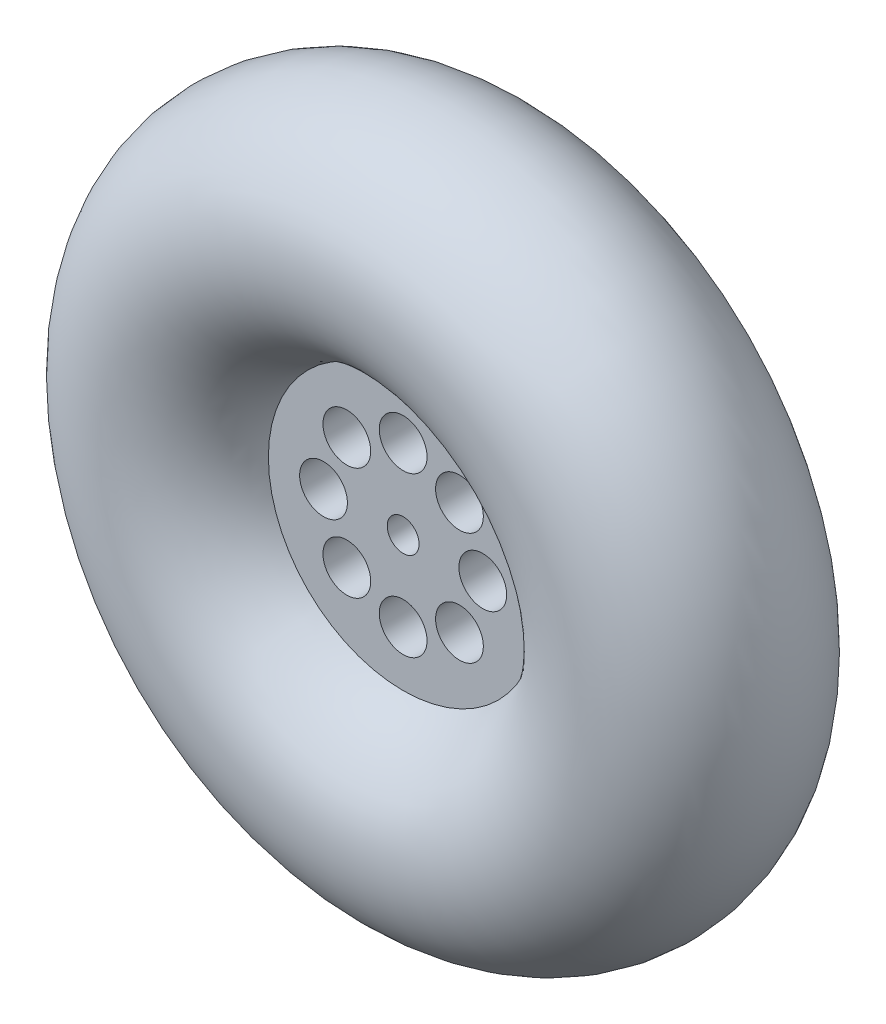
ISO-10303-21;
HEADER;
FILE_DESCRIPTION(('STEP AP214'),'2;1');
FILE_NAME('part.step','',(''),(''),'','','');
FILE_SCHEMA(('AUTOMOTIVE_DESIGN { 1 0 10303 214 1 1 1 1 }'));
ENDSEC;
DATA;
#1=APPLICATION_CONTEXT('core data for automotive mechanical design processes');
#2=APPLICATION_PROTOCOL_DEFINITION('international standard','automotive_design',2000,#1);
#3=PRODUCT_CONTEXT('',#1,'mechanical');
#4=PRODUCT('Part','Part','',(#3));
#5=PRODUCT_RELATED_PRODUCT_CATEGORY('part','',(#4));
#6=PRODUCT_DEFINITION_FORMATION('','',#4);
#7=PRODUCT_DEFINITION_CONTEXT('part definition',#1,'design');
#8=PRODUCT_DEFINITION('design','',#6,#7);
#9=PRODUCT_DEFINITION_SHAPE('','',#8);
#10=(LENGTH_UNIT() NAMED_UNIT(*) SI_UNIT(.MILLI.,.METRE.));
#11=(NAMED_UNIT(*) PLANE_ANGLE_UNIT() SI_UNIT($,.RADIAN.));
#12=(NAMED_UNIT(*) SI_UNIT($,.STERADIAN.) SOLID_ANGLE_UNIT());
#13=UNCERTAINTY_MEASURE_WITH_UNIT(LENGTH_MEASURE(1.E-05),#10,'distance_accuracy_value','');
#14=(GEOMETRIC_REPRESENTATION_CONTEXT(3) GLOBAL_UNCERTAINTY_ASSIGNED_CONTEXT((#13)) GLOBAL_UNIT_ASSIGNED_CONTEXT((#10,
#11,#12)) REPRESENTATION_CONTEXT('',''));
#15=CARTESIAN_POINT('',(0.,0.,0.));
#16=DIRECTION('',(0.,0.,1.));
#17=DIRECTION('',(1.,0.,0.));
#18=AXIS2_PLACEMENT_3D('',#15,#16,#17);
#19=CARTESIAN_POINT('',(0.,0.,0.));
#20=DIRECTION('',(0.,0.,1.));
#21=DIRECTION('',(1.,0.,0.));
#22=AXIS2_PLACEMENT_3D('',#19,#20,#21);
#23=TOROIDAL_SURFACE('',#22,30.,14.);
#24=CARTESIAN_POINT('',(0.,0.,5.));
#25=DIRECTION('',(0.,0.,-1.));
#26=DIRECTION('',(-1.,0.,0.));
#27=AXIS2_PLACEMENT_3D('',#24,#25,#26);
#28=CIRCLE('',#27,16.923303169378);
#29=CARTESIAN_POINT('',(-16.923303169378,0.,5.));
#30=VERTEX_POINT('',#29);
#31=EDGE_CURVE('E42',#30,#30,#28,.T.);
#32=ORIENTED_EDGE('',*,*,#31,.T.);
#33=EDGE_LOOP('',(#32));
#34=FACE_BOUND('',#33,.T.);
#35=CARTESIAN_POINT('',(0.,0.,-5.));
#36=DIRECTION('',(0.,0.,-1.));
#37=DIRECTION('',(-1.,0.,0.));
#38=AXIS2_PLACEMENT_3D('',#35,#36,#37);
#39=CIRCLE('',#38,16.923303169378);
#40=CARTESIAN_POINT('',(-16.923303169378,0.,-5.));
#41=VERTEX_POINT('',#40);
#42=EDGE_CURVE('E10',#41,#41,#39,.T.);
#43=ORIENTED_EDGE('',*,*,#42,.F.);
#44=EDGE_LOOP('',(#43));
#45=FACE_BOUND('',#44,.T.);
#46=ADVANCED_FACE('F35',(#34,#45),#23,.T.);
#47=CARTESIAN_POINT('',(0.,0.,5.));
#48=DIRECTION('',(0.,0.,1.));
#49=DIRECTION('',(1.,0.,0.));
#50=AXIS2_PLACEMENT_3D('',#47,#48,#49);
#51=PLANE('',#50);
#52=CARTESIAN_POINT('',(-7.07106781186535,7.07106781186517,5.));
#53=DIRECTION('',(0.,0.,1.));
#54=DIRECTION('',(1.,0.,0.));
#55=AXIS2_PLACEMENT_3D('',#52,#53,#54);
#56=CIRCLE('',#55,3.00000000000033);
#57=CARTESIAN_POINT('',(-4.07106781186503,7.07106781186517,5.));
#58=VERTEX_POINT('',#57);
#59=EDGE_CURVE('E88',#58,#58,#56,.T.);
#60=ORIENTED_EDGE('',*,*,#59,.F.);
#61=EDGE_LOOP('',(#60));
#62=FACE_BOUND('',#61,.T.);
#63=CARTESIAN_POINT('',(-9.99999999999958,-4.2632564145606E-13,5.));
#64=DIRECTION('',(0.,0.,1.));
#65=DIRECTION('',(1.,0.,0.));
#66=AXIS2_PLACEMENT_3D('',#63,#64,#65);
#67=CIRCLE('',#66,3.00000000000063);
#68=CARTESIAN_POINT('',(-6.99999999999894,-4.2632564145606E-13,5.));
#69=VERTEX_POINT('',#68);
#70=EDGE_CURVE('E91',#69,#69,#67,.T.);
#71=ORIENTED_EDGE('',*,*,#70,.F.);
#72=EDGE_LOOP('',(#71));
#73=FACE_BOUND('',#72,.T.);
#74=CARTESIAN_POINT('',(-7.07106781186475,-7.07106781186578,5.));
#75=DIRECTION('',(0.,0.,1.));
#76=DIRECTION('',(1.,0.,0.));
#77=AXIS2_PLACEMENT_3D('',#74,#75,#76);
#78=CIRCLE('',#77,3.00000000000086);
#79=CARTESIAN_POINT('',(-4.07106781186389,-7.07106781186578,5.));
#80=VERTEX_POINT('',#79);
#81=EDGE_CURVE('E94',#80,#80,#78,.T.);
#82=ORIENTED_EDGE('',*,*,#81,.F.);
#83=EDGE_LOOP('',(#82));
#84=FACE_BOUND('',#83,.T.);
#85=CARTESIAN_POINT('',(8.50201989313825E-13,-10.,5.));
#86=DIRECTION('',(0.,0.,1.));
#87=DIRECTION('',(1.,0.,0.));
#88=AXIS2_PLACEMENT_3D('',#85,#86,#87);
#89=CIRCLE('',#88,3.00000000000088);
#90=CARTESIAN_POINT('',(3.00000000000173,-10.,5.));
#91=VERTEX_POINT('',#90);
#92=EDGE_CURVE('E97',#91,#91,#89,.T.);
#93=ORIENTED_EDGE('',*,*,#92,.F.);
#94=EDGE_LOOP('',(#93));
#95=FACE_BOUND('',#94,.T.);
#96=CARTESIAN_POINT('',(7.0710678118662,-7.07106781186517,5.));
#97=DIRECTION('',(0.,0.,1.));
#98=DIRECTION('',(1.,0.,0.));
#99=AXIS2_PLACEMENT_3D('',#96,#97,#98);
#100=CIRCLE('',#99,3.00000000000066);
#101=CARTESIAN_POINT('',(10.0710678118669,-7.07106781186517,5.));
#102=VERTEX_POINT('',#101);
#103=EDGE_CURVE('E100',#102,#102,#100,.T.);
#104=ORIENTED_EDGE('',*,*,#103,.F.);
#105=EDGE_LOOP('',(#104));
#106=FACE_BOUND('',#105,.T.);
#107=CARTESIAN_POINT('',(10.0000000000004,4.25100994656913E-13,5.));
#108=DIRECTION('',(0.,0.,1.));
#109=DIRECTION('',(1.,0.,0.));
#110=AXIS2_PLACEMENT_3D('',#107,#108,#109);
#111=CIRCLE('',#110,3.00000000000032);
#112=CARTESIAN_POINT('',(13.0000000000007,4.25100994656913E-13,5.));
#113=VERTEX_POINT('',#112);
#114=EDGE_CURVE('E103',#113,#113,#111,.T.);
#115=ORIENTED_EDGE('',*,*,#114,.F.);
#116=EDGE_LOOP('',(#115));
#117=FACE_BOUND('',#116,.T.);
#118=CARTESIAN_POINT('',(7.0710678118656,7.07106781186578,5.));
#119=DIRECTION('',(0.,0.,1.));
#120=DIRECTION('',(1.,0.,0.));
#121=AXIS2_PLACEMENT_3D('',#118,#119,#120);
#122=CIRCLE('',#121,3.00000000000005);
#123=CARTESIAN_POINT('',(10.0710678118656,7.07106781186578,5.));
#124=VERTEX_POINT('',#123);
#125=EDGE_CURVE('E87',#124,#124,#122,.T.);
#126=ORIENTED_EDGE('',*,*,#125,.F.);
#127=EDGE_LOOP('',(#126));
#128=FACE_BOUND('',#127,.T.);
#129=CARTESIAN_POINT('',(0.,10.,5.));
#130=DIRECTION('',(0.,0.,1.));
#131=DIRECTION('',(1.,0.,0.));
#132=AXIS2_PLACEMENT_3D('',#129,#130,#131);
#133=CIRCLE('',#132,3.);
#134=CARTESIAN_POINT('',(3.,10.,5.));
#135=VERTEX_POINT('',#134);
#136=EDGE_CURVE('E57',#135,#135,#133,.T.);
#137=ORIENTED_EDGE('',*,*,#136,.F.);
#138=EDGE_LOOP('',(#137));
#139=FACE_BOUND('',#138,.T.);
#140=CARTESIAN_POINT('',(0.,0.,5.));
#141=DIRECTION('',(0.,0.,1.));
#142=DIRECTION('',(1.,0.,0.));
#143=AXIS2_PLACEMENT_3D('',#140,#141,#142);
#144=CIRCLE('',#143,2.);
#145=CARTESIAN_POINT('',(2.,0.,5.));
#146=VERTEX_POINT('',#145);
#147=EDGE_CURVE('E47',#146,#146,#144,.T.);
#148=ORIENTED_EDGE('',*,*,#147,.F.);
#149=EDGE_LOOP('',(#148));
#150=FACE_BOUND('',#149,.T.);
#151=ORIENTED_EDGE('',*,*,#31,.F.);
#152=EDGE_LOOP('',(#151));
#153=FACE_BOUND('',#152,.T.);
#154=ADVANCED_FACE('F112',(#62,#73,#84,#95,#106,#117,#128,#139,#150,#153),#51,.T.);
#155=CARTESIAN_POINT('',(0.,0.,-5.));
#156=DIRECTION('',(0.,0.,1.));
#157=DIRECTION('',(1.,0.,0.));
#158=AXIS2_PLACEMENT_3D('',#155,#156,#157);
#159=PLANE('',#158);
#160=CARTESIAN_POINT('',(-7.07106781186535,7.07106781186517,-5.));
#161=DIRECTION('',(0.,0.,1.));
#162=DIRECTION('',(1.,0.,0.));
#163=AXIS2_PLACEMENT_3D('',#160,#161,#162);
#164=CIRCLE('',#163,3.00000000000033);
#165=CARTESIAN_POINT('',(-4.07106781186503,7.07106781186517,-5.));
#166=VERTEX_POINT('',#165);
#167=EDGE_CURVE('E38',#166,#166,#164,.T.);
#168=ORIENTED_EDGE('',*,*,#167,.T.);
#169=EDGE_LOOP('',(#168));
#170=FACE_BOUND('',#169,.T.);
#171=CARTESIAN_POINT('',(-9.99999999999958,-4.2632564145606E-13,-5.));
#172=DIRECTION('',(0.,0.,1.));
#173=DIRECTION('',(1.,0.,0.));
#174=AXIS2_PLACEMENT_3D('',#171,#172,#173);
#175=CIRCLE('',#174,3.00000000000063);
#176=CARTESIAN_POINT('',(-6.99999999999894,-4.2632564145606E-13,-5.));
#177=VERTEX_POINT('',#176);
#178=EDGE_CURVE('E71',#177,#177,#175,.T.);
#179=ORIENTED_EDGE('',*,*,#178,.T.);
#180=EDGE_LOOP('',(#179));
#181=FACE_BOUND('',#180,.T.);
#182=CARTESIAN_POINT('',(-7.07106781186475,-7.07106781186578,-5.));
#183=DIRECTION('',(0.,0.,1.));
#184=DIRECTION('',(1.,0.,0.));
#185=AXIS2_PLACEMENT_3D('',#182,#183,#184);
#186=CIRCLE('',#185,3.00000000000086);
#187=CARTESIAN_POINT('',(-4.07106781186389,-7.07106781186578,-5.));
#188=VERTEX_POINT('',#187);
#189=EDGE_CURVE('E69',#188,#188,#186,.T.);
#190=ORIENTED_EDGE('',*,*,#189,.T.);
#191=EDGE_LOOP('',(#190));
#192=FACE_BOUND('',#191,.T.);
#193=CARTESIAN_POINT('',(8.50201989313825E-13,-10.,-5.));
#194=DIRECTION('',(0.,0.,1.));
#195=DIRECTION('',(1.,0.,0.));
#196=AXIS2_PLACEMENT_3D('',#193,#194,#195);
#197=CIRCLE('',#196,3.00000000000088);
#198=CARTESIAN_POINT('',(3.00000000000173,-10.,-5.));
#199=VERTEX_POINT('',#198);
#200=EDGE_CURVE('E66',#199,#199,#197,.T.);
#201=ORIENTED_EDGE('',*,*,#200,.T.);
#202=EDGE_LOOP('',(#201));
#203=FACE_BOUND('',#202,.T.);
#204=CARTESIAN_POINT('',(7.0710678118662,-7.07106781186517,-5.));
#205=DIRECTION('',(0.,0.,1.));
#206=DIRECTION('',(1.,0.,0.));
#207=AXIS2_PLACEMENT_3D('',#204,#205,#206);
#208=CIRCLE('',#207,3.00000000000066);
#209=CARTESIAN_POINT('',(10.0710678118669,-7.07106781186517,-5.));
#210=VERTEX_POINT('',#209);
#211=EDGE_CURVE('E63',#210,#210,#208,.T.);
#212=ORIENTED_EDGE('',*,*,#211,.T.);
#213=EDGE_LOOP('',(#212));
#214=FACE_BOUND('',#213,.T.);
#215=CARTESIAN_POINT('',(10.0000000000004,4.25100994656913E-13,-5.));
#216=DIRECTION('',(0.,0.,1.));
#217=DIRECTION('',(1.,0.,0.));
#218=AXIS2_PLACEMENT_3D('',#215,#216,#217);
#219=CIRCLE('',#218,3.00000000000032);
#220=CARTESIAN_POINT('',(13.0000000000007,4.25100994656913E-13,-5.));
#221=VERTEX_POINT('',#220);
#222=EDGE_CURVE('E60',#221,#221,#219,.T.);
#223=ORIENTED_EDGE('',*,*,#222,.T.);
#224=EDGE_LOOP('',(#223));
#225=FACE_BOUND('',#224,.T.);
#226=CARTESIAN_POINT('',(7.0710678118656,7.07106781186578,-5.));
#227=DIRECTION('',(0.,0.,1.));
#228=DIRECTION('',(1.,0.,0.));
#229=AXIS2_PLACEMENT_3D('',#226,#227,#228);
#230=CIRCLE('',#229,3.00000000000005);
#231=CARTESIAN_POINT('',(10.0710678118656,7.07106781186578,-5.));
#232=VERTEX_POINT('',#231);
#233=EDGE_CURVE('E56',#232,#232,#230,.T.);
#234=ORIENTED_EDGE('',*,*,#233,.T.);
#235=EDGE_LOOP('',(#234));
#236=FACE_BOUND('',#235,.T.);
#237=CARTESIAN_POINT('',(0.,10.,-5.));
#238=DIRECTION('',(0.,0.,1.));
#239=DIRECTION('',(1.,0.,0.));
#240=AXIS2_PLACEMENT_3D('',#237,#238,#239);
#241=CIRCLE('',#240,3.);
#242=CARTESIAN_POINT('',(3.,10.,-5.));
#243=VERTEX_POINT('',#242);
#244=EDGE_CURVE('E53',#243,#243,#241,.T.);
#245=ORIENTED_EDGE('',*,*,#244,.T.);
#246=EDGE_LOOP('',(#245));
#247=FACE_BOUND('',#246,.T.);
#248=CARTESIAN_POINT('',(0.,0.,-5.));
#249=DIRECTION('',(0.,0.,1.));
#250=DIRECTION('',(1.,0.,0.));
#251=AXIS2_PLACEMENT_3D('',#248,#249,#250);
#252=CIRCLE('',#251,2.);
#253=CARTESIAN_POINT('',(2.,0.,-5.));
#254=VERTEX_POINT('',#253);
#255=EDGE_CURVE('E50',#254,#254,#252,.T.);
#256=ORIENTED_EDGE('',*,*,#255,.T.);
#257=EDGE_LOOP('',(#256));
#258=FACE_BOUND('',#257,.T.);
#259=ORIENTED_EDGE('',*,*,#42,.T.);
#260=EDGE_LOOP('',(#259));
#261=FACE_BOUND('',#260,.T.);
#262=ADVANCED_FACE('F115',(#170,#181,#192,#203,#214,#225,#236,#247,#258,#261),#159,.F.);
#263=CARTESIAN_POINT('',(0.,0.,5.));
#264=DIRECTION('',(0.,0.,-1.));
#265=DIRECTION('',(-1.,0.,0.));
#266=AXIS2_PLACEMENT_3D('',#263,#264,#265);
#267=CYLINDRICAL_SURFACE('',#266,2.);
#268=ORIENTED_EDGE('',*,*,#147,.T.);
#269=EDGE_LOOP('',(#268));
#270=FACE_BOUND('',#269,.T.);
#271=ORIENTED_EDGE('',*,*,#255,.F.);
#272=EDGE_LOOP('',(#271));
#273=FACE_BOUND('',#272,.T.);
#274=ADVANCED_FACE('F138',(#270,#273),#267,.F.);
#275=CARTESIAN_POINT('',(0.,10.,-14.));
#276=DIRECTION('',(0.,0.,1.));
#277=DIRECTION('',(1.,0.,0.));
#278=AXIS2_PLACEMENT_3D('',#275,#276,#277);
#279=CYLINDRICAL_SURFACE('',#278,3.);
#280=ORIENTED_EDGE('',*,*,#136,.T.);
#281=EDGE_LOOP('',(#280));
#282=FACE_BOUND('',#281,.T.);
#283=ORIENTED_EDGE('',*,*,#244,.F.);
#284=EDGE_LOOP('',(#283));
#285=FACE_BOUND('',#284,.T.);
#286=ADVANCED_FACE('F144',(#282,#285),#279,.F.);
#287=CARTESIAN_POINT('',(7.0710678118656,7.07106781186578,-14.));
#288=DIRECTION('',(0.,0.,1.));
#289=DIRECTION('',(1.,0.,0.));
#290=AXIS2_PLACEMENT_3D('',#287,#288,#289);
#291=CYLINDRICAL_SURFACE('',#290,3.00000000000005);
#292=ORIENTED_EDGE('',*,*,#125,.T.);
#293=EDGE_LOOP('',(#292));
#294=FACE_BOUND('',#293,.T.);
#295=ORIENTED_EDGE('',*,*,#233,.F.);
#296=EDGE_LOOP('',(#295));
#297=FACE_BOUND('',#296,.T.);
#298=ADVANCED_FACE('F109',(#294,#297),#291,.F.);
#299=CARTESIAN_POINT('',(10.0000000000004,4.25100994656913E-13,-14.));
#300=DIRECTION('',(0.,0.,1.));
#301=DIRECTION('',(1.,0.,0.));
#302=AXIS2_PLACEMENT_3D('',#299,#300,#301);
#303=CYLINDRICAL_SURFACE('',#302,3.00000000000032);
#304=ORIENTED_EDGE('',*,*,#114,.T.);
#305=EDGE_LOOP('',(#304));
#306=FACE_BOUND('',#305,.T.);
#307=ORIENTED_EDGE('',*,*,#222,.F.);
#308=EDGE_LOOP('',(#307));
#309=FACE_BOUND('',#308,.T.);
#310=ADVANCED_FACE('F157',(#306,#309),#303,.F.);
#311=CARTESIAN_POINT('',(7.0710678118662,-7.07106781186517,-14.));
#312=DIRECTION('',(0.,0.,1.));
#313=DIRECTION('',(1.,0.,0.));
#314=AXIS2_PLACEMENT_3D('',#311,#312,#313);
#315=CYLINDRICAL_SURFACE('',#314,3.00000000000066);
#316=ORIENTED_EDGE('',*,*,#103,.T.);
#317=EDGE_LOOP('',(#316));
#318=FACE_BOUND('',#317,.T.);
#319=ORIENTED_EDGE('',*,*,#211,.F.);
#320=EDGE_LOOP('',(#319));
#321=FACE_BOUND('',#320,.T.);
#322=ADVANCED_FACE('F164',(#318,#321),#315,.F.);
#323=CARTESIAN_POINT('',(8.50201989313825E-13,-10.,-14.));
#324=DIRECTION('',(0.,0.,1.));
#325=DIRECTION('',(1.,0.,0.));
#326=AXIS2_PLACEMENT_3D('',#323,#324,#325);
#327=CYLINDRICAL_SURFACE('',#326,3.00000000000088);
#328=ORIENTED_EDGE('',*,*,#92,.T.);
#329=EDGE_LOOP('',(#328));
#330=FACE_BOUND('',#329,.T.);
#331=ORIENTED_EDGE('',*,*,#200,.F.);
#332=EDGE_LOOP('',(#331));
#333=FACE_BOUND('',#332,.T.);
#334=ADVANCED_FACE('F172',(#330,#333),#327,.F.);
#335=CARTESIAN_POINT('',(-7.07106781186475,-7.07106781186578,-14.));
#336=DIRECTION('',(0.,0.,1.));
#337=DIRECTION('',(1.,0.,0.));
#338=AXIS2_PLACEMENT_3D('',#335,#336,#337);
#339=CYLINDRICAL_SURFACE('',#338,3.00000000000086);
#340=ORIENTED_EDGE('',*,*,#81,.T.);
#341=EDGE_LOOP('',(#340));
#342=FACE_BOUND('',#341,.T.);
#343=ORIENTED_EDGE('',*,*,#189,.F.);
#344=EDGE_LOOP('',(#343));
#345=FACE_BOUND('',#344,.T.);
#346=ADVANCED_FACE('F180',(#342,#345),#339,.F.);
#347=CARTESIAN_POINT('',(-9.99999999999958,-4.2632564145606E-13,-14.));
#348=DIRECTION('',(0.,0.,1.));
#349=DIRECTION('',(1.,0.,0.));
#350=AXIS2_PLACEMENT_3D('',#347,#348,#349);
#351=CYLINDRICAL_SURFACE('',#350,3.00000000000063);
#352=ORIENTED_EDGE('',*,*,#70,.T.);
#353=EDGE_LOOP('',(#352));
#354=FACE_BOUND('',#353,.T.);
#355=ORIENTED_EDGE('',*,*,#178,.F.);
#356=EDGE_LOOP('',(#355));
#357=FACE_BOUND('',#356,.T.);
#358=ADVANCED_FACE('F188',(#354,#357),#351,.F.);
#359=CARTESIAN_POINT('',(-7.07106781186535,7.07106781186517,-14.));
#360=DIRECTION('',(0.,0.,1.));
#361=DIRECTION('',(1.,0.,0.));
#362=AXIS2_PLACEMENT_3D('',#359,#360,#361);
#363=CYLINDRICAL_SURFACE('',#362,3.00000000000033);
#364=ORIENTED_EDGE('',*,*,#59,.T.);
#365=EDGE_LOOP('',(#364));
#366=FACE_BOUND('',#365,.T.);
#367=ORIENTED_EDGE('',*,*,#167,.F.);
#368=EDGE_LOOP('',(#367));
#369=FACE_BOUND('',#368,.T.);
#370=ADVANCED_FACE('F196',(#366,#369),#363,.F.);
#371=CLOSED_SHELL('',(#46,#154,#262,#274,#286,#298,#310,#322,#334,#346,#358,#370));
#372=MANIFOLD_SOLID_BREP('B2',#371);
#373=ADVANCED_BREP_SHAPE_REPRESENTATION('',(#18,#372),#14);
#374=SHAPE_DEFINITION_REPRESENTATION(#9,#373);
ENDSEC;
END-ISO-10303-21;
